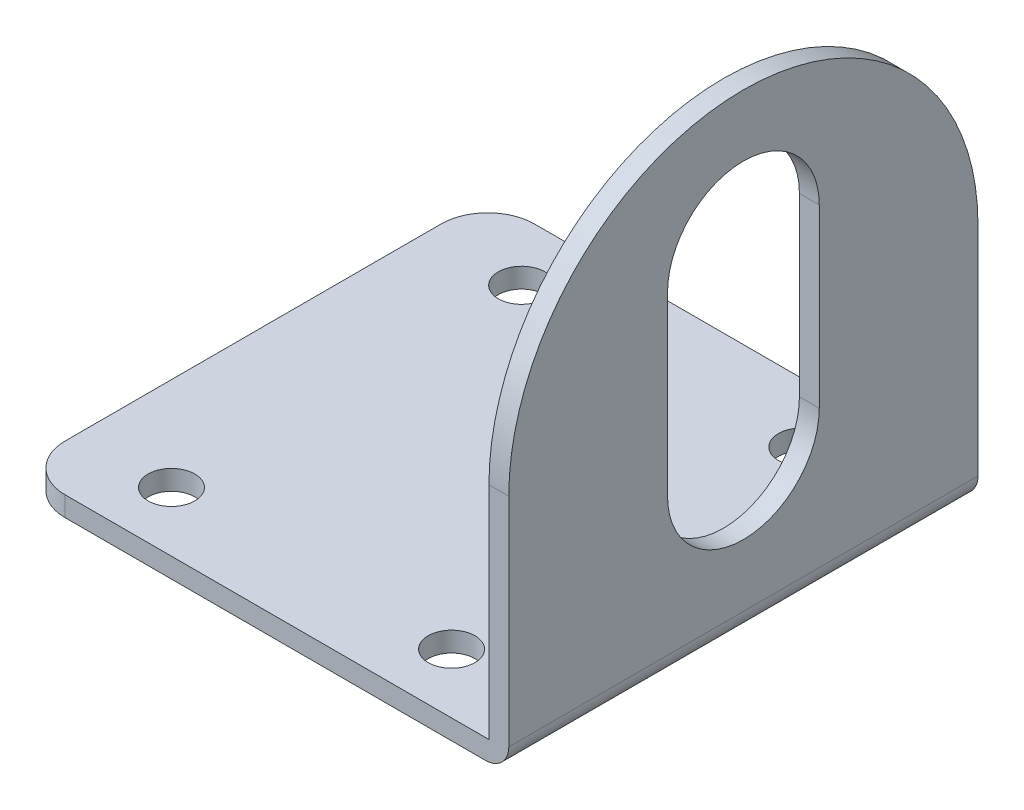
ISO-10303-21;
HEADER;
FILE_DESCRIPTION(('STEP AP214'),'2;1');
FILE_NAME('part.step','',(''),(''),'','','');
FILE_SCHEMA(('AUTOMOTIVE_DESIGN { 1 0 10303 214 1 1 1 1 }'));
ENDSEC;
DATA;
#1=APPLICATION_CONTEXT('core data for automotive mechanical design processes');
#2=APPLICATION_PROTOCOL_DEFINITION('international standard','automotive_design',2000,#1);
#3=PRODUCT_CONTEXT('',#1,'mechanical');
#4=PRODUCT('Part','Part','',(#3));
#5=PRODUCT_RELATED_PRODUCT_CATEGORY('part','',(#4));
#6=PRODUCT_DEFINITION_FORMATION('','',#4);
#7=PRODUCT_DEFINITION_CONTEXT('part definition',#1,'design');
#8=PRODUCT_DEFINITION('design','',#6,#7);
#9=PRODUCT_DEFINITION_SHAPE('','',#8);
#10=(LENGTH_UNIT() NAMED_UNIT(*) SI_UNIT(.MILLI.,.METRE.));
#11=(NAMED_UNIT(*) PLANE_ANGLE_UNIT() SI_UNIT($,.RADIAN.));
#12=(NAMED_UNIT(*) SI_UNIT($,.STERADIAN.) SOLID_ANGLE_UNIT());
#13=UNCERTAINTY_MEASURE_WITH_UNIT(LENGTH_MEASURE(1.E-05),#10,'distance_accuracy_value','');
#14=(GEOMETRIC_REPRESENTATION_CONTEXT(3) GLOBAL_UNCERTAINTY_ASSIGNED_CONTEXT((#13)) GLOBAL_UNIT_ASSIGNED_CONTEXT((#10,
#11,#12)) REPRESENTATION_CONTEXT('',''));
#15=CARTESIAN_POINT('',(0.,0.,0.));
#16=DIRECTION('',(0.,0.,1.));
#17=DIRECTION('',(1.,0.,0.));
#18=AXIS2_PLACEMENT_3D('',#15,#16,#17);
#19=CARTESIAN_POINT('',(-0.299999999999993,0.300000000000009,40.2));
#20=DIRECTION('',(0.,0.,-1.));
#21=DIRECTION('',(-1.,0.,0.));
#22=AXIS2_PLACEMENT_3D('',#19,#20,#21);
#23=CYLINDRICAL_SURFACE('',#22,2.);
#24=DIRECTION('',(0.,0.,-1.));
#25=VECTOR('',#24,1.);
#26=CARTESIAN_POINT('',(1.70000000000001,0.300000000000009,40.2));
#27=LINE('',#26,#25);
#28=CARTESIAN_POINT('',(1.70000000000001,0.300000000000002,40.2));
#29=VERTEX_POINT('',#28);
#30=CARTESIAN_POINT('',(1.70000000000001,0.300000000000002,0.));
#31=VERTEX_POINT('',#30);
#32=EDGE_CURVE('E229',#29,#31,#27,.T.);
#33=ORIENTED_EDGE('',*,*,#32,.F.);
#34=CARTESIAN_POINT('',(-0.299999999999993,0.300000000000009,40.2));
#35=DIRECTION('',(0.,0.,1.));
#36=DIRECTION('',(1.,0.,0.));
#37=AXIS2_PLACEMENT_3D('',#34,#35,#36);
#38=CIRCLE('',#37,2.);
#39=CARTESIAN_POINT('',(-0.299999999999992,-1.69999999999999,40.2));
#40=VERTEX_POINT('',#39);
#41=EDGE_CURVE('E41',#40,#29,#38,.T.);
#42=ORIENTED_EDGE('',*,*,#41,.F.);
#43=DIRECTION('',(0.,0.,-1.));
#44=VECTOR('',#43,1.);
#45=CARTESIAN_POINT('',(-0.299999999999993,-1.69999999999999,40.2));
#46=LINE('',#45,#44);
#47=CARTESIAN_POINT('',(-0.299999999999992,-1.69999999999999,0.));
#48=VERTEX_POINT('',#47);
#49=EDGE_CURVE('E232',#48,#40,#46,.F.);
#50=ORIENTED_EDGE('',*,*,#49,.F.);
#51=CARTESIAN_POINT('',(-0.299999999999993,0.300000000000009,0.));
#52=DIRECTION('',(0.,0.,1.));
#53=DIRECTION('',(1.,0.,0.));
#54=AXIS2_PLACEMENT_3D('',#51,#52,#53);
#55=CIRCLE('',#54,2.);
#56=EDGE_CURVE('E11',#31,#48,#55,.F.);
#57=ORIENTED_EDGE('',*,*,#56,.F.);
#58=EDGE_LOOP('',(#33,#42,#50,#57));
#59=FACE_BOUND('',#58,.T.);
#60=ADVANCED_FACE('F34',(#59),#23,.T.);
#61=CARTESIAN_POINT('',(1.7,18.9,20.1));
#62=DIRECTION('',(-1.,0.,0.));
#63=DIRECTION('',(0.,0.,1.));
#64=AXIS2_PLACEMENT_3D('',#61,#62,#63);
#65=CYLINDRICAL_SURFACE('',#64,20.1);
#66=DIRECTION('',(1.,0.,0.));
#67=VECTOR('',#66,1.);
#68=CARTESIAN_POINT('',(1.7,18.9,40.2));
#69=LINE('',#68,#67);
#70=CARTESIAN_POINT('',(1.7,18.9,40.2));
#71=VERTEX_POINT('',#70);
#72=CARTESIAN_POINT('',(0.,18.9,40.2));
#73=VERTEX_POINT('',#72);
#74=EDGE_CURVE('E209',#71,#73,#69,.F.);
#75=ORIENTED_EDGE('',*,*,#74,.F.);
#76=CARTESIAN_POINT('',(1.7,18.9,20.1));
#77=DIRECTION('',(-1.,0.,0.));
#78=DIRECTION('',(0.,-1.,0.));
#79=AXIS2_PLACEMENT_3D('',#76,#77,#78);
#80=CIRCLE('',#79,20.1);
#81=CARTESIAN_POINT('',(1.7,18.9,0.));
#82=VERTEX_POINT('',#81);
#83=EDGE_CURVE('E215',#82,#71,#80,.F.);
#84=ORIENTED_EDGE('',*,*,#83,.F.);
#85=DIRECTION('',(-1.,0.,0.));
#86=VECTOR('',#85,1.);
#87=CARTESIAN_POINT('',(0.,18.9,0.));
#88=LINE('',#87,#86);
#89=CARTESIAN_POINT('',(0.,18.9,0.));
#90=VERTEX_POINT('',#89);
#91=EDGE_CURVE('E212',#90,#82,#88,.F.);
#92=ORIENTED_EDGE('',*,*,#91,.F.);
#93=CARTESIAN_POINT('',(0.,18.9,20.1));
#94=DIRECTION('',(1.,0.,0.));
#95=DIRECTION('',(0.,1.,0.));
#96=AXIS2_PLACEMENT_3D('',#93,#94,#95);
#97=CIRCLE('',#96,20.1);
#98=EDGE_CURVE('E218',#73,#90,#97,.F.);
#99=ORIENTED_EDGE('',*,*,#98,.F.);
#100=EDGE_LOOP('',(#75,#84,#92,#99));
#101=FACE_BOUND('',#100,.T.);
#102=ADVANCED_FACE('F241',(#101),#65,.T.);
#103=CARTESIAN_POINT('',(-36.3,0.,36.2));
#104=DIRECTION('',(0.,1.,0.));
#105=DIRECTION('',(0.,0.,1.));
#106=AXIS2_PLACEMENT_3D('',#103,#104,#105);
#107=CYLINDRICAL_SURFACE('',#106,4.);
#108=DIRECTION('',(0.,-1.,0.));
#109=VECTOR('',#108,1.);
#110=CARTESIAN_POINT('',(-36.3,0.,40.2));
#111=LINE('',#110,#109);
#112=CARTESIAN_POINT('',(-36.3,0.,40.2));
#113=VERTEX_POINT('',#112);
#114=CARTESIAN_POINT('',(-36.3,-1.7,40.2));
#115=VERTEX_POINT('',#114);
#116=EDGE_CURVE('E199',#113,#115,#111,.T.);
#117=ORIENTED_EDGE('',*,*,#116,.F.);
#118=CARTESIAN_POINT('',(-36.3,0.,36.2));
#119=DIRECTION('',(0.,-1.,0.));
#120=DIRECTION('',(0.,0.,-1.));
#121=AXIS2_PLACEMENT_3D('',#118,#119,#120);
#122=CIRCLE('',#121,4.);
#123=CARTESIAN_POINT('',(-40.3,0.,36.2));
#124=VERTEX_POINT('',#123);
#125=EDGE_CURVE('E205',#124,#113,#122,.F.);
#126=ORIENTED_EDGE('',*,*,#125,.F.);
#127=DIRECTION('',(0.,-1.,0.));
#128=VECTOR('',#127,1.);
#129=CARTESIAN_POINT('',(-40.3,0.,36.2));
#130=LINE('',#129,#128);
#131=CARTESIAN_POINT('',(-40.3,-1.7,36.2));
#132=VERTEX_POINT('',#131);
#133=EDGE_CURVE('E202',#132,#124,#130,.F.);
#134=ORIENTED_EDGE('',*,*,#133,.F.);
#135=CARTESIAN_POINT('',(-36.3,-1.7,36.2));
#136=DIRECTION('',(0.,1.,0.));
#137=DIRECTION('',(-1.,0.,0.));
#138=AXIS2_PLACEMENT_3D('',#135,#136,#137);
#139=CIRCLE('',#138,4.);
#140=EDGE_CURVE('E207',#115,#132,#139,.F.);
#141=ORIENTED_EDGE('',*,*,#140,.F.);
#142=EDGE_LOOP('',(#117,#126,#134,#141));
#143=FACE_BOUND('',#142,.T.);
#144=ADVANCED_FACE('F266',(#143),#107,.T.);
#145=CARTESIAN_POINT('',(-36.3,0.,4.));
#146=DIRECTION('',(0.,1.,0.));
#147=DIRECTION('',(0.,0.,1.));
#148=AXIS2_PLACEMENT_3D('',#145,#146,#147);
#149=CYLINDRICAL_SURFACE('',#148,4.);
#150=DIRECTION('',(0.,1.,0.));
#151=VECTOR('',#150,1.);
#152=CARTESIAN_POINT('',(-36.3,0.,0.));
#153=LINE('',#152,#151);
#154=CARTESIAN_POINT('',(-36.3,-1.7,0.));
#155=VERTEX_POINT('',#154);
#156=CARTESIAN_POINT('',(-36.3,0.,0.));
#157=VERTEX_POINT('',#156);
#158=EDGE_CURVE('E188',#155,#157,#153,.T.);
#159=ORIENTED_EDGE('',*,*,#158,.F.);
#160=CARTESIAN_POINT('',(-36.3,-1.7,4.));
#161=DIRECTION('',(0.,1.,0.));
#162=DIRECTION('',(-1.,0.,0.));
#163=AXIS2_PLACEMENT_3D('',#160,#161,#162);
#164=CIRCLE('',#163,4.);
#165=CARTESIAN_POINT('',(-40.3,-1.7,4.));
#166=VERTEX_POINT('',#165);
#167=EDGE_CURVE('E194',#166,#155,#164,.F.);
#168=ORIENTED_EDGE('',*,*,#167,.F.);
#169=DIRECTION('',(0.,1.,0.));
#170=VECTOR('',#169,1.);
#171=CARTESIAN_POINT('',(-40.3,-1.7,4.));
#172=LINE('',#171,#170);
#173=CARTESIAN_POINT('',(-40.3,0.,4.));
#174=VERTEX_POINT('',#173);
#175=EDGE_CURVE('E191',#174,#166,#172,.F.);
#176=ORIENTED_EDGE('',*,*,#175,.F.);
#177=CARTESIAN_POINT('',(-36.3,0.,4.));
#178=DIRECTION('',(0.,-1.,0.));
#179=DIRECTION('',(0.,0.,-1.));
#180=AXIS2_PLACEMENT_3D('',#177,#178,#179);
#181=CIRCLE('',#180,4.);
#182=EDGE_CURVE('E196',#157,#174,#181,.F.);
#183=ORIENTED_EDGE('',*,*,#182,.F.);
#184=EDGE_LOOP('',(#159,#168,#176,#183));
#185=FACE_BOUND('',#184,.T.);
#186=ADVANCED_FACE('F262',(#185),#149,.T.);
#187=CARTESIAN_POINT('',(-40.3,0.,40.2));
#188=DIRECTION('',(0.,-1.,0.));
#189=DIRECTION('',(0.,0.,-1.));
#190=AXIS2_PLACEMENT_3D('',#187,#188,#189);
#191=PLANE('',#190);
#192=CARTESIAN_POINT('',(-32.3,0.,35.1));
#193=DIRECTION('',(0.,-1.,0.));
#194=DIRECTION('',(0.,0.,-1.));
#195=AXIS2_PLACEMENT_3D('',#192,#193,#194);
#196=CIRCLE('',#195,2.00000000000001);
#197=CARTESIAN_POINT('',(-32.3,0.,33.1));
#198=VERTEX_POINT('',#197);
#199=EDGE_CURVE('E462',#198,#198,#196,.T.);
#200=ORIENTED_EDGE('',*,*,#199,.T.);
#201=EDGE_LOOP('',(#200));
#202=FACE_BOUND('',#201,.T.);
#203=CARTESIAN_POINT('',(-8.3,0.,35.1));
#204=DIRECTION('',(0.,-1.,0.));
#205=DIRECTION('',(0.,0.,-1.));
#206=AXIS2_PLACEMENT_3D('',#203,#204,#205);
#207=CIRCLE('',#206,2.);
#208=CARTESIAN_POINT('',(-8.3,0.,33.1));
#209=VERTEX_POINT('',#208);
#210=EDGE_CURVE('E459',#209,#209,#207,.T.);
#211=ORIENTED_EDGE('',*,*,#210,.T.);
#212=EDGE_LOOP('',(#211));
#213=FACE_BOUND('',#212,.T.);
#214=CARTESIAN_POINT('',(-8.3,0.,5.1));
#215=DIRECTION('',(0.,-1.,0.));
#216=DIRECTION('',(0.,0.,-1.));
#217=AXIS2_PLACEMENT_3D('',#214,#215,#216);
#218=CIRCLE('',#217,2.);
#219=CARTESIAN_POINT('',(-8.3,0.,3.1));
#220=VERTEX_POINT('',#219);
#221=EDGE_CURVE('E451',#220,#220,#218,.T.);
#222=ORIENTED_EDGE('',*,*,#221,.T.);
#223=EDGE_LOOP('',(#222));
#224=FACE_BOUND('',#223,.T.);
#225=CARTESIAN_POINT('',(-32.3,0.,5.1));
#226=DIRECTION('',(0.,-1.,0.));
#227=DIRECTION('',(0.,0.,-1.));
#228=AXIS2_PLACEMENT_3D('',#225,#226,#227);
#229=CIRCLE('',#228,2.);
#230=CARTESIAN_POINT('',(-32.3,0.,3.1));
#231=VERTEX_POINT('',#230);
#232=EDGE_CURVE('E448',#231,#231,#229,.T.);
#233=ORIENTED_EDGE('',*,*,#232,.T.);
#234=EDGE_LOOP('',(#233));
#235=FACE_BOUND('',#234,.T.);
#236=DIRECTION('',(0.,0.,-1.));
#237=VECTOR('',#236,1.);
#238=CARTESIAN_POINT('',(-40.3,0.,40.2));
#239=LINE('',#238,#237);
#240=EDGE_CURVE('E186',#124,#174,#239,.T.);
#241=ORIENTED_EDGE('',*,*,#240,.F.);
#242=ORIENTED_EDGE('',*,*,#125,.T.);
#243=DIRECTION('',(-1.,0.,0.));
#244=VECTOR('',#243,1.);
#245=CARTESIAN_POINT('',(-40.3,0.,40.2));
#246=LINE('',#245,#244);
#247=CARTESIAN_POINT('',(0.,0.,40.2));
#248=VERTEX_POINT('',#247);
#249=EDGE_CURVE('E162',#248,#113,#246,.T.);
#250=ORIENTED_EDGE('',*,*,#249,.F.);
#251=DIRECTION('',(0.,0.,-1.));
#252=VECTOR('',#251,1.);
#253=CARTESIAN_POINT('',(0.,0.,40.2));
#254=LINE('',#253,#252);
#255=CARTESIAN_POINT('',(0.,0.,0.));
#256=VERTEX_POINT('',#255);
#257=EDGE_CURVE('E173',#248,#256,#254,.T.);
#258=ORIENTED_EDGE('',*,*,#257,.T.);
#259=DIRECTION('',(-1.,0.,0.));
#260=VECTOR('',#259,1.);
#261=CARTESIAN_POINT('',(-40.3,0.,0.));
#262=LINE('',#261,#260);
#263=EDGE_CURVE('E159',#256,#157,#262,.T.);
#264=ORIENTED_EDGE('',*,*,#263,.T.);
#265=ORIENTED_EDGE('',*,*,#182,.T.);
#266=EDGE_LOOP('',(#241,#242,#250,#258,#264,#265));
#267=FACE_BOUND('',#266,.T.);
#268=ADVANCED_FACE('F251',(#202,#213,#224,#235,#267),#191,.F.);
#269=CARTESIAN_POINT('',(-40.3,-1.7,40.2));
#270=DIRECTION('',(1.,0.,0.));
#271=DIRECTION('',(0.,0.,-1.));
#272=AXIS2_PLACEMENT_3D('',#269,#270,#271);
#273=PLANE('',#272);
#274=DIRECTION('',(0.,0.,-1.));
#275=VECTOR('',#274,1.);
#276=CARTESIAN_POINT('',(-40.3,-1.7,40.2));
#277=LINE('',#276,#275);
#278=EDGE_CURVE('E184',#132,#166,#277,.T.);
#279=ORIENTED_EDGE('',*,*,#278,.F.);
#280=ORIENTED_EDGE('',*,*,#133,.T.);
#281=ORIENTED_EDGE('',*,*,#240,.T.);
#282=ORIENTED_EDGE('',*,*,#175,.T.);
#283=EDGE_LOOP('',(#279,#280,#281,#282));
#284=FACE_BOUND('',#283,.T.);
#285=ADVANCED_FACE('F265',(#284),#273,.F.);
#286=CARTESIAN_POINT('',(1.70000000000001,-1.69999999999999,40.2));
#287=DIRECTION('',(0.,1.,0.));
#288=DIRECTION('',(-1.,0.,0.));
#289=AXIS2_PLACEMENT_3D('',#286,#287,#288);
#290=PLANE('',#289);
#291=CARTESIAN_POINT('',(-32.3,-1.7,35.1));
#292=DIRECTION('',(0.,-1.,0.));
#293=DIRECTION('',(-1.,0.,0.));
#294=AXIS2_PLACEMENT_3D('',#291,#292,#293);
#295=CIRCLE('',#294,2.00000000000001);
#296=CARTESIAN_POINT('',(-34.3,-1.7,35.1));
#297=VERTEX_POINT('',#296);
#298=EDGE_CURVE('E436',#297,#297,#295,.T.);
#299=ORIENTED_EDGE('',*,*,#298,.F.);
#300=EDGE_LOOP('',(#299));
#301=FACE_BOUND('',#300,.T.);
#302=CARTESIAN_POINT('',(-8.3,-1.7,35.1));
#303=DIRECTION('',(0.,-1.,0.));
#304=DIRECTION('',(-1.,0.,0.));
#305=AXIS2_PLACEMENT_3D('',#302,#303,#304);
#306=CIRCLE('',#305,2.);
#307=CARTESIAN_POINT('',(-10.3,-1.7,35.1));
#308=VERTEX_POINT('',#307);
#309=EDGE_CURVE('E440',#308,#308,#306,.T.);
#310=ORIENTED_EDGE('',*,*,#309,.F.);
#311=EDGE_LOOP('',(#310));
#312=FACE_BOUND('',#311,.T.);
#313=CARTESIAN_POINT('',(-8.3,-1.7,5.1));
#314=DIRECTION('',(0.,-1.,0.));
#315=DIRECTION('',(1.,0.,0.));
#316=AXIS2_PLACEMENT_3D('',#313,#314,#315);
#317=CIRCLE('',#316,2.);
#318=CARTESIAN_POINT('',(-6.29999999999999,-1.7,5.1));
#319=VERTEX_POINT('',#318);
#320=EDGE_CURVE('E444',#319,#319,#317,.T.);
#321=ORIENTED_EDGE('',*,*,#320,.F.);
#322=EDGE_LOOP('',(#321));
#323=FACE_BOUND('',#322,.T.);
#324=CARTESIAN_POINT('',(-32.3,-1.7,5.1));
#325=DIRECTION('',(0.,-1.,0.));
#326=DIRECTION('',(1.,0.,0.));
#327=AXIS2_PLACEMENT_3D('',#324,#325,#326);
#328=CIRCLE('',#327,2.);
#329=CARTESIAN_POINT('',(-30.3,-1.7,5.1));
#330=VERTEX_POINT('',#329);
#331=EDGE_CURVE('E447',#330,#330,#328,.T.);
#332=ORIENTED_EDGE('',*,*,#331,.F.);
#333=EDGE_LOOP('',(#332));
#334=FACE_BOUND('',#333,.T.);
#335=DIRECTION('',(1.,0.,0.));
#336=VECTOR('',#335,1.);
#337=CARTESIAN_POINT('',(1.70000000000001,-1.69999999999999,0.));
#338=LINE('',#337,#336);
#339=EDGE_CURVE('E176',#155,#48,#338,.T.);
#340=ORIENTED_EDGE('',*,*,#339,.T.);
#341=ORIENTED_EDGE('',*,*,#49,.T.);
#342=DIRECTION('',(1.,0.,0.));
#343=VECTOR('',#342,1.);
#344=CARTESIAN_POINT('',(1.70000000000001,-1.69999999999999,40.2));
#345=LINE('',#344,#343);
#346=EDGE_CURVE('E165',#115,#40,#345,.T.);
#347=ORIENTED_EDGE('',*,*,#346,.F.);
#348=ORIENTED_EDGE('',*,*,#140,.T.);
#349=ORIENTED_EDGE('',*,*,#278,.T.);
#350=ORIENTED_EDGE('',*,*,#167,.T.);
#351=EDGE_LOOP('',(#340,#341,#347,#348,#349,#350));
#352=FACE_BOUND('',#351,.T.);
#353=ADVANCED_FACE('F255',(#301,#312,#323,#334,#352),#290,.F.);
#354=CARTESIAN_POINT('',(1.7,39.,40.2));
#355=DIRECTION('',(-1.,0.,0.));
#356=DIRECTION('',(0.,-1.,0.));
#357=AXIS2_PLACEMENT_3D('',#354,#355,#356);
#358=PLANE('',#357);
#359=DIRECTION('',(0.,1.,0.));
#360=VECTOR('',#359,1.);
#361=CARTESIAN_POINT('',(1.70000000000001,12.1271419808871,13.6));
#362=LINE('',#361,#360);
#363=CARTESIAN_POINT('',(1.7,12.1271419808871,13.6));
#364=VERTEX_POINT('',#363);
#365=CARTESIAN_POINT('',(1.7,27.2132240448455,13.6));
#366=VERTEX_POINT('',#365);
#367=EDGE_CURVE('E142',#364,#366,#362,.T.);
#368=ORIENTED_EDGE('',*,*,#367,.F.);
#369=CARTESIAN_POINT('',(1.70000000000001,12.1271419808871,20.1));
#370=DIRECTION('',(1.,0.,0.));
#371=DIRECTION('',(0.,1.,0.));
#372=AXIS2_PLACEMENT_3D('',#369,#370,#371);
#373=CIRCLE('',#372,6.5);
#374=CARTESIAN_POINT('',(1.70000000000001,12.1271419808871,26.6));
#375=VERTEX_POINT('',#374);
#376=EDGE_CURVE('E147',#375,#364,#373,.T.);
#377=ORIENTED_EDGE('',*,*,#376,.F.);
#378=DIRECTION('',(0.,-1.,0.));
#379=VECTOR('',#378,1.);
#380=CARTESIAN_POINT('',(1.70000000000001,12.1271419808871,26.6));
#381=LINE('',#380,#379);
#382=CARTESIAN_POINT('',(1.7,27.2132240448455,26.6));
#383=VERTEX_POINT('',#382);
#384=EDGE_CURVE('E152',#383,#375,#381,.T.);
#385=ORIENTED_EDGE('',*,*,#384,.F.);
#386=CARTESIAN_POINT('',(1.7,27.2132240448455,20.1));
#387=DIRECTION('',(1.,0.,0.));
#388=DIRECTION('',(0.,1.,0.));
#389=AXIS2_PLACEMENT_3D('',#386,#387,#388);
#390=CIRCLE('',#389,6.5);
#391=EDGE_CURVE('E131',#366,#383,#390,.T.);
#392=ORIENTED_EDGE('',*,*,#391,.F.);
#393=EDGE_LOOP('',(#368,#377,#385,#392));
#394=FACE_BOUND('',#393,.T.);
#395=DIRECTION('',(0.,1.,0.));
#396=VECTOR('',#395,1.);
#397=CARTESIAN_POINT('',(1.7,39.,40.2));
#398=LINE('',#397,#396);
#399=EDGE_CURVE('E169',#29,#71,#398,.T.);
#400=ORIENTED_EDGE('',*,*,#399,.F.);
#401=ORIENTED_EDGE('',*,*,#32,.T.);
#402=DIRECTION('',(0.,1.,0.));
#403=VECTOR('',#402,1.);
#404=CARTESIAN_POINT('',(1.7,39.,0.));
#405=LINE('',#404,#403);
#406=EDGE_CURVE('E179',#31,#82,#405,.T.);
#407=ORIENTED_EDGE('',*,*,#406,.T.);
#408=ORIENTED_EDGE('',*,*,#83,.T.);
#409=EDGE_LOOP('',(#400,#401,#407,#408));
#410=FACE_BOUND('',#409,.T.);
#411=ADVANCED_FACE('F149',(#394,#410),#358,.F.);
#412=CARTESIAN_POINT('',(0.,0.,40.2));
#413=DIRECTION('',(1.,0.,0.));
#414=DIRECTION('',(0.,1.,0.));
#415=AXIS2_PLACEMENT_3D('',#412,#413,#414);
#416=PLANE('',#415);
#417=DIRECTION('',(0.,-1.,0.));
#418=VECTOR('',#417,1.);
#419=CARTESIAN_POINT('',(0.,0.,26.6));
#420=LINE('',#419,#418);
#421=CARTESIAN_POINT('',(0.,27.2132240448455,26.6));
#422=VERTEX_POINT('',#421);
#423=CARTESIAN_POINT('',(0.,12.1271419808871,26.6));
#424=VERTEX_POINT('',#423);
#425=EDGE_CURVE('E223',#422,#424,#420,.T.);
#426=ORIENTED_EDGE('',*,*,#425,.T.);
#427=CARTESIAN_POINT('',(0.,12.1271419808871,20.1));
#428=DIRECTION('',(1.,0.,0.));
#429=DIRECTION('',(0.,1.,0.));
#430=AXIS2_PLACEMENT_3D('',#427,#428,#429);
#431=CIRCLE('',#430,6.5);
#432=CARTESIAN_POINT('',(0.,12.1271419808871,13.6));
#433=VERTEX_POINT('',#432);
#434=EDGE_CURVE('E226',#424,#433,#431,.T.);
#435=ORIENTED_EDGE('',*,*,#434,.T.);
#436=DIRECTION('',(0.,1.,0.));
#437=VECTOR('',#436,1.);
#438=CARTESIAN_POINT('',(0.,0.,13.6));
#439=LINE('',#438,#437);
#440=CARTESIAN_POINT('',(0.,27.2132240448455,13.6));
#441=VERTEX_POINT('',#440);
#442=EDGE_CURVE('E220',#433,#441,#439,.T.);
#443=ORIENTED_EDGE('',*,*,#442,.T.);
#444=CARTESIAN_POINT('',(0.,27.2132240448455,20.1));
#445=DIRECTION('',(1.,0.,0.));
#446=DIRECTION('',(0.,1.,0.));
#447=AXIS2_PLACEMENT_3D('',#444,#445,#446);
#448=CIRCLE('',#447,6.5);
#449=EDGE_CURVE('E134',#441,#422,#448,.T.);
#450=ORIENTED_EDGE('',*,*,#449,.T.);
#451=EDGE_LOOP('',(#426,#435,#443,#450));
#452=FACE_BOUND('',#451,.T.);
#453=DIRECTION('',(0.,-1.,0.));
#454=VECTOR('',#453,1.);
#455=CARTESIAN_POINT('',(0.,0.,40.2));
#456=LINE('',#455,#454);
#457=EDGE_CURVE('E171',#73,#248,#456,.T.);
#458=ORIENTED_EDGE('',*,*,#457,.F.);
#459=ORIENTED_EDGE('',*,*,#98,.T.);
#460=DIRECTION('',(0.,-1.,0.));
#461=VECTOR('',#460,1.);
#462=CARTESIAN_POINT('',(0.,0.,0.));
#463=LINE('',#462,#461);
#464=EDGE_CURVE('E166',#90,#256,#463,.T.);
#465=ORIENTED_EDGE('',*,*,#464,.T.);
#466=ORIENTED_EDGE('',*,*,#257,.F.);
#467=EDGE_LOOP('',(#458,#459,#465,#466));
#468=FACE_BOUND('',#467,.T.);
#469=ADVANCED_FACE('F245',(#452,#468),#416,.F.);
#470=CARTESIAN_POINT('',(0.,0.,40.2));
#471=DIRECTION('',(0.,0.,1.));
#472=DIRECTION('',(1.,0.,0.));
#473=AXIS2_PLACEMENT_3D('',#470,#471,#472);
#474=PLANE('',#473);
#475=ORIENTED_EDGE('',*,*,#346,.T.);
#476=ORIENTED_EDGE('',*,*,#41,.T.);
#477=ORIENTED_EDGE('',*,*,#399,.T.);
#478=ORIENTED_EDGE('',*,*,#74,.T.);
#479=ORIENTED_EDGE('',*,*,#457,.T.);
#480=ORIENTED_EDGE('',*,*,#249,.T.);
#481=ORIENTED_EDGE('',*,*,#116,.T.);
#482=EDGE_LOOP('',(#475,#476,#477,#478,#479,#480,#481));
#483=FACE_BOUND('',#482,.T.);
#484=ADVANCED_FACE('F234',(#483),#474,.T.);
#485=CARTESIAN_POINT('',(0.,0.,0.));
#486=DIRECTION('',(0.,0.,1.));
#487=DIRECTION('',(1.,0.,0.));
#488=AXIS2_PLACEMENT_3D('',#485,#486,#487);
#489=PLANE('',#488);
#490=ORIENTED_EDGE('',*,*,#406,.F.);
#491=ORIENTED_EDGE('',*,*,#56,.T.);
#492=ORIENTED_EDGE('',*,*,#339,.F.);
#493=ORIENTED_EDGE('',*,*,#158,.T.);
#494=ORIENTED_EDGE('',*,*,#263,.F.);
#495=ORIENTED_EDGE('',*,*,#464,.F.);
#496=ORIENTED_EDGE('',*,*,#91,.T.);
#497=EDGE_LOOP('',(#490,#491,#492,#493,#494,#495,#496));
#498=FACE_BOUND('',#497,.T.);
#499=ADVANCED_FACE('F259',(#498),#489,.F.);
#500=CARTESIAN_POINT('',(-36.3,12.1271419808871,20.1));
#501=DIRECTION('',(1.,0.,0.));
#502=DIRECTION('',(0.,1.,0.));
#503=AXIS2_PLACEMENT_3D('',#500,#501,#502);
#504=CYLINDRICAL_SURFACE('',#503,6.5);
#505=DIRECTION('',(1.,0.,0.));
#506=VECTOR('',#505,1.);
#507=CARTESIAN_POINT('',(-36.3,12.1271419808871,26.6));
#508=LINE('',#507,#506);
#509=EDGE_CURVE('E157',#424,#375,#508,.T.);
#510=ORIENTED_EDGE('',*,*,#509,.T.);
#511=ORIENTED_EDGE('',*,*,#376,.T.);
#512=DIRECTION('',(1.,0.,0.));
#513=VECTOR('',#512,1.);
#514=CARTESIAN_POINT('',(-36.3,12.1271419808871,13.6));
#515=LINE('',#514,#513);
#516=EDGE_CURVE('E138',#433,#364,#515,.T.);
#517=ORIENTED_EDGE('',*,*,#516,.F.);
#518=ORIENTED_EDGE('',*,*,#434,.F.);
#519=EDGE_LOOP('',(#510,#511,#517,#518));
#520=FACE_BOUND('',#519,.T.);
#521=ADVANCED_FACE('F307',(#520),#504,.F.);
#522=CARTESIAN_POINT('',(-36.3,12.1271419808871,26.6));
#523=DIRECTION('',(0.,0.,1.));
#524=DIRECTION('',(0.,-1.,0.));
#525=AXIS2_PLACEMENT_3D('',#522,#523,#524);
#526=PLANE('',#525);
#527=DIRECTION('',(1.,0.,0.));
#528=VECTOR('',#527,1.);
#529=CARTESIAN_POINT('',(-36.3,27.2132240448455,26.6));
#530=LINE('',#529,#528);
#531=EDGE_CURVE('E137',#422,#383,#530,.T.);
#532=ORIENTED_EDGE('',*,*,#531,.T.);
#533=ORIENTED_EDGE('',*,*,#384,.T.);
#534=ORIENTED_EDGE('',*,*,#509,.F.);
#535=ORIENTED_EDGE('',*,*,#425,.F.);
#536=EDGE_LOOP('',(#532,#533,#534,#535));
#537=FACE_BOUND('',#536,.T.);
#538=ADVANCED_FACE('F311',(#537),#526,.F.);
#539=CARTESIAN_POINT('',(-36.3,27.2132240448455,20.1));
#540=DIRECTION('',(1.,0.,0.));
#541=DIRECTION('',(0.,1.,0.));
#542=AXIS2_PLACEMENT_3D('',#539,#540,#541);
#543=CYLINDRICAL_SURFACE('',#542,6.5);
#544=DIRECTION('',(1.,0.,0.));
#545=VECTOR('',#544,1.);
#546=CARTESIAN_POINT('',(-36.3,27.2132240448455,13.6));
#547=LINE('',#546,#545);
#548=EDGE_CURVE('E126',#441,#366,#547,.T.);
#549=ORIENTED_EDGE('',*,*,#548,.T.);
#550=ORIENTED_EDGE('',*,*,#391,.T.);
#551=ORIENTED_EDGE('',*,*,#531,.F.);
#552=ORIENTED_EDGE('',*,*,#449,.F.);
#553=EDGE_LOOP('',(#549,#550,#551,#552));
#554=FACE_BOUND('',#553,.T.);
#555=ADVANCED_FACE('F128',(#554),#543,.F.);
#556=CARTESIAN_POINT('',(-36.3,12.1271419808871,13.6));
#557=DIRECTION('',(0.,0.,-1.));
#558=DIRECTION('',(0.,1.,0.));
#559=AXIS2_PLACEMENT_3D('',#556,#557,#558);
#560=PLANE('',#559);
#561=ORIENTED_EDGE('',*,*,#516,.T.);
#562=ORIENTED_EDGE('',*,*,#367,.T.);
#563=ORIENTED_EDGE('',*,*,#548,.F.);
#564=ORIENTED_EDGE('',*,*,#442,.F.);
#565=EDGE_LOOP('',(#561,#562,#563,#564));
#566=FACE_BOUND('',#565,.T.);
#567=ADVANCED_FACE('F143',(#566),#560,.F.);
#568=CARTESIAN_POINT('',(-32.3,36.3,5.1));
#569=DIRECTION('',(0.,-1.,0.));
#570=DIRECTION('',(1.,0.,0.));
#571=AXIS2_PLACEMENT_3D('',#568,#569,#570);
#572=CYLINDRICAL_SURFACE('',#571,2.);
#573=ORIENTED_EDGE('',*,*,#331,.T.);
#574=EDGE_LOOP('',(#573));
#575=FACE_BOUND('',#574,.T.);
#576=ORIENTED_EDGE('',*,*,#232,.F.);
#577=EDGE_LOOP('',(#576));
#578=FACE_BOUND('',#577,.T.);
#579=ADVANCED_FACE('F339',(#575,#578),#572,.F.);
#580=CARTESIAN_POINT('',(-8.3,36.3,5.1));
#581=DIRECTION('',(0.,-1.,0.));
#582=DIRECTION('',(1.,0.,0.));
#583=AXIS2_PLACEMENT_3D('',#580,#581,#582);
#584=CYLINDRICAL_SURFACE('',#583,2.);
#585=ORIENTED_EDGE('',*,*,#320,.T.);
#586=EDGE_LOOP('',(#585));
#587=FACE_BOUND('',#586,.T.);
#588=ORIENTED_EDGE('',*,*,#221,.F.);
#589=EDGE_LOOP('',(#588));
#590=FACE_BOUND('',#589,.T.);
#591=ADVANCED_FACE('F357',(#587,#590),#584,.F.);
#592=CARTESIAN_POINT('',(-8.3,36.3,35.1));
#593=DIRECTION('',(0.,-1.,0.));
#594=DIRECTION('',(1.,0.,0.));
#595=AXIS2_PLACEMENT_3D('',#592,#593,#594);
#596=CYLINDRICAL_SURFACE('',#595,2.);
#597=ORIENTED_EDGE('',*,*,#309,.T.);
#598=EDGE_LOOP('',(#597));
#599=FACE_BOUND('',#598,.T.);
#600=ORIENTED_EDGE('',*,*,#210,.F.);
#601=EDGE_LOOP('',(#600));
#602=FACE_BOUND('',#601,.T.);
#603=ADVANCED_FACE('F367',(#599,#602),#596,.F.);
#604=CARTESIAN_POINT('',(-32.3,36.3,35.1));
#605=DIRECTION('',(0.,-1.,0.));
#606=DIRECTION('',(1.,0.,0.));
#607=AXIS2_PLACEMENT_3D('',#604,#605,#606);
#608=CYLINDRICAL_SURFACE('',#607,2.00000000000001);
#609=ORIENTED_EDGE('',*,*,#298,.T.);
#610=EDGE_LOOP('',(#609));
#611=FACE_BOUND('',#610,.T.);
#612=ORIENTED_EDGE('',*,*,#199,.F.);
#613=EDGE_LOOP('',(#612));
#614=FACE_BOUND('',#613,.T.);
#615=ADVANCED_FACE('F376',(#611,#614),#608,.F.);
#616=CLOSED_SHELL('',(#60,#102,#144,#186,#268,#285,#353,#411,#469,#484,#499,#521,#538,#555,#567,
#579,#591,#603,#615));
#617=MANIFOLD_SOLID_BREP('B2',#616);
#618=ADVANCED_BREP_SHAPE_REPRESENTATION('',(#18,#617),#14);
#619=SHAPE_DEFINITION_REPRESENTATION(#9,#618);
ENDSEC;
END-ISO-10303-21;
